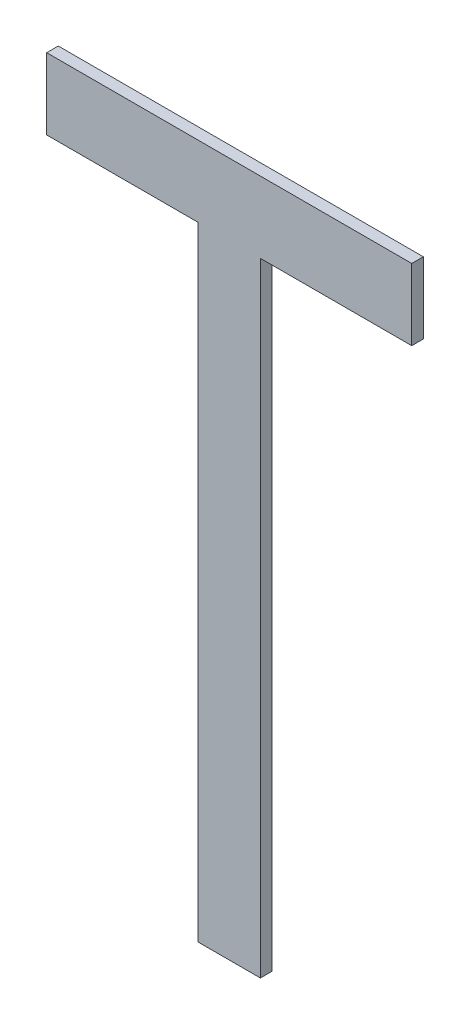
ISO-10303-21;
HEADER;
FILE_DESCRIPTION(('STEP AP214'),'2;1');
FILE_NAME('part.step','',(''),(''),'','','');
FILE_SCHEMA(('AUTOMOTIVE_DESIGN { 1 0 10303 214 1 1 1 1 }'));
ENDSEC;
DATA;
#1=APPLICATION_CONTEXT('core data for automotive mechanical design processes');
#2=APPLICATION_PROTOCOL_DEFINITION('international standard','automotive_design',2000,#1);
#3=PRODUCT_CONTEXT('',#1,'mechanical');
#4=PRODUCT('Part','Part','',(#3));
#5=PRODUCT_RELATED_PRODUCT_CATEGORY('part','',(#4));
#6=PRODUCT_DEFINITION_FORMATION('','',#4);
#7=PRODUCT_DEFINITION_CONTEXT('part definition',#1,'design');
#8=PRODUCT_DEFINITION('design','',#6,#7);
#9=PRODUCT_DEFINITION_SHAPE('','',#8);
#10=(LENGTH_UNIT() NAMED_UNIT(*) SI_UNIT(.MILLI.,.METRE.));
#11=(NAMED_UNIT(*) PLANE_ANGLE_UNIT() SI_UNIT($,.RADIAN.));
#12=(NAMED_UNIT(*) SI_UNIT($,.STERADIAN.) SOLID_ANGLE_UNIT());
#13=UNCERTAINTY_MEASURE_WITH_UNIT(LENGTH_MEASURE(1.E-05),#10,'distance_accuracy_value','');
#14=(GEOMETRIC_REPRESENTATION_CONTEXT(3) GLOBAL_UNCERTAINTY_ASSIGNED_CONTEXT((#13)) GLOBAL_UNIT_ASSIGNED_CONTEXT((#10,
#11,#12)) REPRESENTATION_CONTEXT('',''));
#15=CARTESIAN_POINT('',(0.,0.,0.));
#16=DIRECTION('',(0.,0.,1.));
#17=DIRECTION('',(1.,0.,0.));
#18=AXIS2_PLACEMENT_3D('',#15,#16,#17);
#19=CARTESIAN_POINT('',(0.767692307692307,0.24390475768074,0.551));
#20=DIRECTION('',(0.,-1.,0.));
#21=DIRECTION('',(0.,0.,-1.));
#22=AXIS2_PLACEMENT_3D('',#19,#20,#21);
#23=PLANE('',#22);
#24=DIRECTION('',(-1.,0.,0.));
#25=VECTOR('',#24,1.);
#26=CARTESIAN_POINT('',(0.767692307692307,0.24390475768074,0.55));
#27=LINE('',#26,#25);
#28=CARTESIAN_POINT('',(0.767692307692307,0.24390475768074,0.55));
#29=VERTEX_POINT('',#28);
#30=CARTESIAN_POINT('',(0.754615384615384,0.24390475768074,0.55));
#31=VERTEX_POINT('',#30);
#32=EDGE_CURVE('E11',#29,#31,#27,.T.);
#33=ORIENTED_EDGE('',*,*,#32,.F.);
#34=DIRECTION('',(0.,0.,-1.));
#35=VECTOR('',#34,1.);
#36=CARTESIAN_POINT('',(0.767692307692307,0.24390475768074,0.551));
#37=LINE('',#36,#35);
#38=CARTESIAN_POINT('',(0.767692307692307,0.24390475768074,0.551));
#39=VERTEX_POINT('',#38);
#40=EDGE_CURVE('E149',#39,#29,#37,.T.);
#41=ORIENTED_EDGE('',*,*,#40,.F.);
#42=DIRECTION('',(-1.,0.,0.));
#43=VECTOR('',#42,1.);
#44=CARTESIAN_POINT('',(0.767692307692307,0.24390475768074,0.551));
#45=LINE('',#44,#43);
#46=CARTESIAN_POINT('',(0.754615384615384,0.24390475768074,0.551));
#47=VERTEX_POINT('',#46);
#48=EDGE_CURVE('E142',#39,#47,#45,.T.);
#49=ORIENTED_EDGE('',*,*,#48,.T.);
#50=DIRECTION('',(0.,0.,-1.));
#51=VECTOR('',#50,1.);
#52=CARTESIAN_POINT('',(0.754615384615384,0.24390475768074,0.551));
#53=LINE('',#52,#51);
#54=EDGE_CURVE('E97',#47,#31,#53,.T.);
#55=ORIENTED_EDGE('',*,*,#54,.T.);
#56=EDGE_LOOP('',(#33,#41,#49,#55));
#57=FACE_BOUND('',#56,.T.);
#58=ADVANCED_FACE('F17',(#57),#23,.T.);
#59=CARTESIAN_POINT('',(0.767692307692307,0.190058603834586,0.551));
#60=DIRECTION('',(-1.,0.,0.));
#61=DIRECTION('',(0.,0.,1.));
#62=AXIS2_PLACEMENT_3D('',#59,#60,#61);
#63=PLANE('',#62);
#64=DIRECTION('',(0.,1.,0.));
#65=VECTOR('',#64,1.);
#66=CARTESIAN_POINT('',(0.767692307692307,0.190058603834586,0.55));
#67=LINE('',#66,#65);
#68=CARTESIAN_POINT('',(0.767692307692307,0.190058603834586,0.55));
#69=VERTEX_POINT('',#68);
#70=EDGE_CURVE('E24',#69,#29,#67,.T.);
#71=ORIENTED_EDGE('',*,*,#70,.F.);
#72=DIRECTION('',(0.,0.,-1.));
#73=VECTOR('',#72,1.);
#74=CARTESIAN_POINT('',(0.767692307692307,0.190058603834586,0.551));
#75=LINE('',#74,#73);
#76=CARTESIAN_POINT('',(0.767692307692307,0.190058603834586,0.551));
#77=VERTEX_POINT('',#76);
#78=EDGE_CURVE('E144',#77,#69,#75,.T.);
#79=ORIENTED_EDGE('',*,*,#78,.F.);
#80=DIRECTION('',(0.,1.,0.));
#81=VECTOR('',#80,1.);
#82=CARTESIAN_POINT('',(0.767692307692307,0.190058603834586,0.551));
#83=LINE('',#82,#81);
#84=EDGE_CURVE('E133',#77,#39,#83,.T.);
#85=ORIENTED_EDGE('',*,*,#84,.T.);
#86=ORIENTED_EDGE('',*,*,#40,.T.);
#87=EDGE_LOOP('',(#71,#79,#85,#86));
#88=FACE_BOUND('',#87,.T.);
#89=ADVANCED_FACE('F159',(#88),#63,.T.);
#90=CARTESIAN_POINT('',(0.773076923076923,0.190058603834586,0.551));
#91=DIRECTION('',(0.,-1.,0.));
#92=DIRECTION('',(0.,0.,-1.));
#93=AXIS2_PLACEMENT_3D('',#90,#91,#92);
#94=PLANE('',#93);
#95=DIRECTION('',(-1.,0.,0.));
#96=VECTOR('',#95,1.);
#97=CARTESIAN_POINT('',(0.773076923076923,0.190058603834586,0.55));
#98=LINE('',#97,#96);
#99=CARTESIAN_POINT('',(0.773076923076923,0.190058603834586,0.55));
#100=VERTEX_POINT('',#99);
#101=EDGE_CURVE('E146',#100,#69,#98,.T.);
#102=ORIENTED_EDGE('',*,*,#101,.F.);
#103=DIRECTION('',(-1.11022302462503E-13,0.,-1.));
#104=VECTOR('',#103,1.);
#105=CARTESIAN_POINT('',(0.773076923076923,0.190058603834586,0.551));
#106=LINE('',#105,#104);
#107=CARTESIAN_POINT('',(0.773076923076923,0.190058603834586,0.551));
#108=VERTEX_POINT('',#107);
#109=EDGE_CURVE('E136',#108,#100,#106,.T.);
#110=ORIENTED_EDGE('',*,*,#109,.F.);
#111=DIRECTION('',(-1.,0.,0.));
#112=VECTOR('',#111,1.);
#113=CARTESIAN_POINT('',(0.773076923076923,0.190058603834586,0.551));
#114=LINE('',#113,#112);
#115=EDGE_CURVE('E123',#108,#77,#114,.T.);
#116=ORIENTED_EDGE('',*,*,#115,.T.);
#117=ORIENTED_EDGE('',*,*,#78,.T.);
#118=EDGE_LOOP('',(#102,#110,#116,#117));
#119=FACE_BOUND('',#118,.T.);
#120=ADVANCED_FACE('F153',(#119),#94,.T.);
#121=CARTESIAN_POINT('',(0.773076923076923,0.24390475768074,0.551));
#122=DIRECTION('',(1.,0.,0.));
#123=DIRECTION('',(0.,0.,-1.));
#124=AXIS2_PLACEMENT_3D('',#121,#122,#123);
#125=PLANE('',#124);
#126=DIRECTION('',(0.,-1.,0.));
#127=VECTOR('',#126,1.);
#128=CARTESIAN_POINT('',(0.773076923076923,0.24390475768074,0.55));
#129=LINE('',#128,#127);
#130=CARTESIAN_POINT('',(0.773076923076923,0.24390475768074,0.55));
#131=VERTEX_POINT('',#130);
#132=EDGE_CURVE('E139',#131,#100,#129,.T.);
#133=ORIENTED_EDGE('',*,*,#132,.F.);
#134=DIRECTION('',(-1.11022302462503E-13,0.,-1.));
#135=VECTOR('',#134,1.);
#136=CARTESIAN_POINT('',(0.773076923076923,0.24390475768074,0.551));
#137=LINE('',#136,#135);
#138=CARTESIAN_POINT('',(0.773076923076923,0.24390475768074,0.551));
#139=VERTEX_POINT('',#138);
#140=EDGE_CURVE('E126',#139,#131,#137,.T.);
#141=ORIENTED_EDGE('',*,*,#140,.F.);
#142=DIRECTION('',(0.,-1.,0.));
#143=VECTOR('',#142,1.);
#144=CARTESIAN_POINT('',(0.773076923076923,0.24390475768074,0.551));
#145=LINE('',#144,#143);
#146=EDGE_CURVE('E114',#139,#108,#145,.T.);
#147=ORIENTED_EDGE('',*,*,#146,.T.);
#148=ORIENTED_EDGE('',*,*,#109,.T.);
#149=EDGE_LOOP('',(#133,#141,#147,#148));
#150=FACE_BOUND('',#149,.T.);
#151=ADVANCED_FACE('F155',(#150),#125,.T.);
#152=CARTESIAN_POINT('',(0.786153846153846,0.24390475768074,0.551));
#153=DIRECTION('',(0.,-1.,0.));
#154=DIRECTION('',(0.,0.,-1.));
#155=AXIS2_PLACEMENT_3D('',#152,#153,#154);
#156=PLANE('',#155);
#157=DIRECTION('',(-1.,0.,0.));
#158=VECTOR('',#157,1.);
#159=CARTESIAN_POINT('',(0.786153846153846,0.24390475768074,0.55));
#160=LINE('',#159,#158);
#161=CARTESIAN_POINT('',(0.786153846153846,0.24390475768074,0.55));
#162=VERTEX_POINT('',#161);
#163=EDGE_CURVE('E129',#162,#131,#160,.T.);
#164=ORIENTED_EDGE('',*,*,#163,.F.);
#165=DIRECTION('',(0.,0.,-1.));
#166=VECTOR('',#165,1.);
#167=CARTESIAN_POINT('',(0.786153846153846,0.24390475768074,0.551));
#168=LINE('',#167,#166);
#169=CARTESIAN_POINT('',(0.786153846153846,0.24390475768074,0.551));
#170=VERTEX_POINT('',#169);
#171=EDGE_CURVE('E117',#170,#162,#168,.T.);
#172=ORIENTED_EDGE('',*,*,#171,.F.);
#173=DIRECTION('',(-1.,0.,0.));
#174=VECTOR('',#173,1.);
#175=CARTESIAN_POINT('',(0.786153846153846,0.24390475768074,0.551));
#176=LINE('',#175,#174);
#177=EDGE_CURVE('E108',#170,#139,#176,.T.);
#178=ORIENTED_EDGE('',*,*,#177,.T.);
#179=ORIENTED_EDGE('',*,*,#140,.T.);
#180=EDGE_LOOP('',(#164,#172,#178,#179));
#181=FACE_BOUND('',#180,.T.);
#182=ADVANCED_FACE('F163',(#181),#156,.T.);
#183=CARTESIAN_POINT('',(0.786153846153846,0.250058603834586,0.551));
#184=DIRECTION('',(1.,0.,0.));
#185=DIRECTION('',(0.,0.,-1.));
#186=AXIS2_PLACEMENT_3D('',#183,#184,#185);
#187=PLANE('',#186);
#188=DIRECTION('',(0.,-1.,0.));
#189=VECTOR('',#188,1.);
#190=CARTESIAN_POINT('',(0.786153846153846,0.250058603834586,0.55));
#191=LINE('',#190,#189);
#192=CARTESIAN_POINT('',(0.786153846153846,0.250058603834586,0.55));
#193=VERTEX_POINT('',#192);
#194=EDGE_CURVE('E120',#193,#162,#191,.T.);
#195=ORIENTED_EDGE('',*,*,#194,.F.);
#196=DIRECTION('',(0.,0.,-1.));
#197=VECTOR('',#196,1.);
#198=CARTESIAN_POINT('',(0.786153846153846,0.250058603834586,0.551));
#199=LINE('',#198,#197);
#200=CARTESIAN_POINT('',(0.786153846153846,0.250058603834586,0.551));
#201=VERTEX_POINT('',#200);
#202=EDGE_CURVE('E111',#201,#193,#199,.T.);
#203=ORIENTED_EDGE('',*,*,#202,.F.);
#204=DIRECTION('',(0.,-1.,0.));
#205=VECTOR('',#204,1.);
#206=CARTESIAN_POINT('',(0.786153846153846,0.250058603834586,0.551));
#207=LINE('',#206,#205);
#208=EDGE_CURVE('E91',#201,#170,#207,.T.);
#209=ORIENTED_EDGE('',*,*,#208,.T.);
#210=ORIENTED_EDGE('',*,*,#171,.T.);
#211=EDGE_LOOP('',(#195,#203,#209,#210));
#212=FACE_BOUND('',#211,.T.);
#213=ADVANCED_FACE('F161',(#212),#187,.T.);
#214=CARTESIAN_POINT('',(0.754615384615384,0.250058603834586,0.551));
#215=DIRECTION('',(0.,1.,0.));
#216=DIRECTION('',(0.,0.,1.));
#217=AXIS2_PLACEMENT_3D('',#214,#215,#216);
#218=PLANE('',#217);
#219=DIRECTION('',(1.,0.,0.));
#220=VECTOR('',#219,1.);
#221=CARTESIAN_POINT('',(0.754615384615384,0.250058603834586,0.55));
#222=LINE('',#221,#220);
#223=CARTESIAN_POINT('',(0.754615384615384,0.250058603834586,0.55));
#224=VERTEX_POINT('',#223);
#225=EDGE_CURVE('E86',#224,#193,#222,.T.);
#226=ORIENTED_EDGE('',*,*,#225,.F.);
#227=DIRECTION('',(0.,0.,-1.));
#228=VECTOR('',#227,1.);
#229=CARTESIAN_POINT('',(0.754615384615384,0.250058603834586,0.551));
#230=LINE('',#229,#228);
#231=CARTESIAN_POINT('',(0.754615384615384,0.250058603834586,0.551));
#232=VERTEX_POINT('',#231);
#233=EDGE_CURVE('E78',#232,#224,#230,.T.);
#234=ORIENTED_EDGE('',*,*,#233,.F.);
#235=DIRECTION('',(1.,0.,0.));
#236=VECTOR('',#235,1.);
#237=CARTESIAN_POINT('',(0.754615384615384,0.250058603834586,0.551));
#238=LINE('',#237,#236);
#239=EDGE_CURVE('E83',#232,#201,#238,.T.);
#240=ORIENTED_EDGE('',*,*,#239,.T.);
#241=ORIENTED_EDGE('',*,*,#202,.T.);
#242=EDGE_LOOP('',(#226,#234,#240,#241));
#243=FACE_BOUND('',#242,.T.);
#244=ADVANCED_FACE('F80',(#243),#218,.T.);
#245=CARTESIAN_POINT('',(0.754615384615384,0.24390475768074,0.551));
#246=DIRECTION('',(-1.,0.,0.));
#247=DIRECTION('',(0.,0.,1.));
#248=AXIS2_PLACEMENT_3D('',#245,#246,#247);
#249=PLANE('',#248);
#250=DIRECTION('',(0.,1.,0.));
#251=VECTOR('',#250,1.);
#252=CARTESIAN_POINT('',(0.754615384615384,0.24390475768074,0.55));
#253=LINE('',#252,#251);
#254=EDGE_CURVE('E90',#31,#224,#253,.T.);
#255=ORIENTED_EDGE('',*,*,#254,.F.);
#256=ORIENTED_EDGE('',*,*,#54,.F.);
#257=DIRECTION('',(0.,1.,0.));
#258=VECTOR('',#257,1.);
#259=CARTESIAN_POINT('',(0.754615384615384,0.24390475768074,0.551));
#260=LINE('',#259,#258);
#261=EDGE_CURVE('E95',#47,#232,#260,.T.);
#262=ORIENTED_EDGE('',*,*,#261,.T.);
#263=ORIENTED_EDGE('',*,*,#233,.T.);
#264=EDGE_LOOP('',(#255,#256,#262,#263));
#265=FACE_BOUND('',#264,.T.);
#266=ADVANCED_FACE('F96',(#265),#249,.T.);
#267=CARTESIAN_POINT('',(0.,0.,0.551));
#268=DIRECTION('',(0.,0.,-1.));
#269=DIRECTION('',(-1.,0.,0.));
#270=AXIS2_PLACEMENT_3D('',#267,#268,#269);
#271=PLANE('',#270);
#272=ORIENTED_EDGE('',*,*,#48,.F.);
#273=ORIENTED_EDGE('',*,*,#84,.F.);
#274=ORIENTED_EDGE('',*,*,#115,.F.);
#275=ORIENTED_EDGE('',*,*,#146,.F.);
#276=ORIENTED_EDGE('',*,*,#177,.F.);
#277=ORIENTED_EDGE('',*,*,#208,.F.);
#278=ORIENTED_EDGE('',*,*,#239,.F.);
#279=ORIENTED_EDGE('',*,*,#261,.F.);
#280=EDGE_LOOP('',(#272,#273,#274,#275,#276,#277,#278,#279));
#281=FACE_BOUND('',#280,.T.);
#282=ADVANCED_FACE('F101',(#281),#271,.F.);
#283=CARTESIAN_POINT('',(0.,0.,0.55));
#284=DIRECTION('',(0.,0.,-1.));
#285=DIRECTION('',(-1.,0.,0.));
#286=AXIS2_PLACEMENT_3D('',#283,#284,#285);
#287=PLANE('',#286);
#288=ORIENTED_EDGE('',*,*,#32,.T.);
#289=ORIENTED_EDGE('',*,*,#254,.T.);
#290=ORIENTED_EDGE('',*,*,#225,.T.);
#291=ORIENTED_EDGE('',*,*,#194,.T.);
#292=ORIENTED_EDGE('',*,*,#163,.T.);
#293=ORIENTED_EDGE('',*,*,#132,.T.);
#294=ORIENTED_EDGE('',*,*,#101,.T.);
#295=ORIENTED_EDGE('',*,*,#70,.T.);
#296=EDGE_LOOP('',(#288,#289,#290,#291,#292,#293,#294,#295));
#297=FACE_BOUND('',#296,.T.);
#298=ADVANCED_FACE('F151',(#297),#287,.T.);
#299=CLOSED_SHELL('',(#58,#89,#120,#151,#182,#213,#244,#266,#282,#298));
#300=MANIFOLD_SOLID_BREP('B1',#299);
#301=ADVANCED_BREP_SHAPE_REPRESENTATION('',(#18,#300),#14);
#302=SHAPE_DEFINITION_REPRESENTATION(#9,#301);
ENDSEC;
END-ISO-10303-21;
